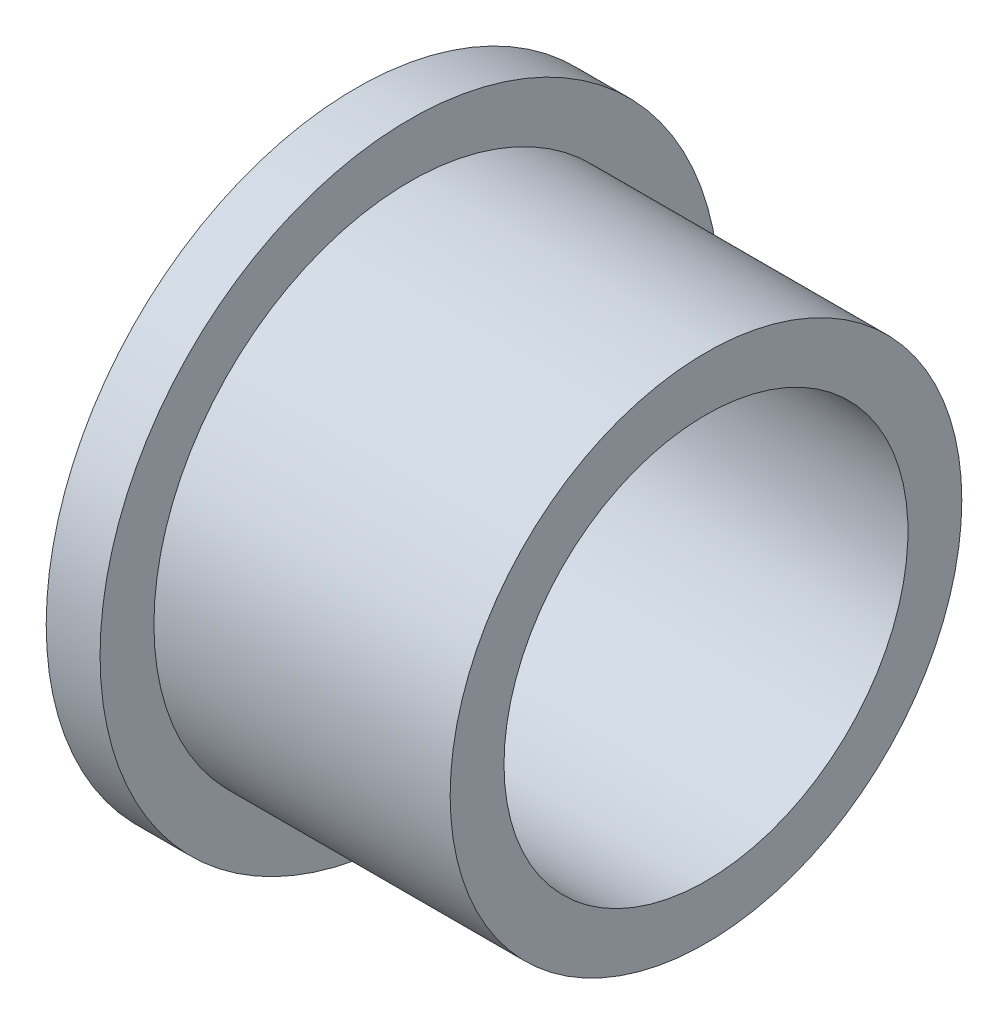
ISO-10303-21;
HEADER;
FILE_DESCRIPTION(('STEP AP214'),'2;1');
FILE_NAME('part.step','',(''),(''),'','','');
FILE_SCHEMA(('AUTOMOTIVE_DESIGN { 1 0 10303 214 1 1 1 1 }'));
ENDSEC;
DATA;
#1=APPLICATION_CONTEXT('core data for automotive mechanical design processes');
#2=APPLICATION_PROTOCOL_DEFINITION('international standard','automotive_design',2000,#1);
#3=PRODUCT_CONTEXT('',#1,'mechanical');
#4=PRODUCT('Part','Part','',(#3));
#5=PRODUCT_RELATED_PRODUCT_CATEGORY('part','',(#4));
#6=PRODUCT_DEFINITION_FORMATION('','',#4);
#7=PRODUCT_DEFINITION_CONTEXT('part definition',#1,'design');
#8=PRODUCT_DEFINITION('design','',#6,#7);
#9=PRODUCT_DEFINITION_SHAPE('','',#8);
#10=(LENGTH_UNIT() NAMED_UNIT(*) SI_UNIT(.MILLI.,.METRE.));
#11=(NAMED_UNIT(*) PLANE_ANGLE_UNIT() SI_UNIT($,.RADIAN.));
#12=(NAMED_UNIT(*) SI_UNIT($,.STERADIAN.) SOLID_ANGLE_UNIT());
#13=UNCERTAINTY_MEASURE_WITH_UNIT(LENGTH_MEASURE(1.E-05),#10,'distance_accuracy_value','');
#14=(GEOMETRIC_REPRESENTATION_CONTEXT(3) GLOBAL_UNCERTAINTY_ASSIGNED_CONTEXT((#13)) GLOBAL_UNIT_ASSIGNED_CONTEXT((#10,
#11,#12)) REPRESENTATION_CONTEXT('',''));
#15=CARTESIAN_POINT('',(0.,0.,0.));
#16=DIRECTION('',(0.,0.,1.));
#17=DIRECTION('',(1.,0.,0.));
#18=AXIS2_PLACEMENT_3D('',#15,#16,#17);
#19=CARTESIAN_POINT('',(0.,0.,0.));
#20=DIRECTION('',(-1.,0.,0.));
#21=DIRECTION('',(0.,0.,1.));
#22=AXIS2_PLACEMENT_3D('',#19,#20,#21);
#23=CYLINDRICAL_SURFACE('',#22,7.5);
#24=CARTESIAN_POINT('',(13.,0.,0.));
#25=DIRECTION('',(-1.,0.,0.));
#26=DIRECTION('',(0.,0.,1.));
#27=AXIS2_PLACEMENT_3D('',#24,#25,#26);
#28=CIRCLE('',#27,7.5);
#29=CARTESIAN_POINT('',(13.,0.,7.5));
#30=VERTEX_POINT('',#29);
#31=EDGE_CURVE('E36',#30,#30,#28,.T.);
#32=ORIENTED_EDGE('',*,*,#31,.F.);
#33=EDGE_LOOP('',(#32));
#34=FACE_BOUND('',#33,.T.);
#35=CARTESIAN_POINT('',(0.,0.,0.));
#36=DIRECTION('',(-1.,0.,0.));
#37=DIRECTION('',(0.,0.,1.));
#38=AXIS2_PLACEMENT_3D('',#35,#36,#37);
#39=CIRCLE('',#38,7.5);
#40=CARTESIAN_POINT('',(0.,0.,7.5));
#41=VERTEX_POINT('',#40);
#42=EDGE_CURVE('E10',#41,#41,#39,.T.);
#43=ORIENTED_EDGE('',*,*,#42,.T.);
#44=EDGE_LOOP('',(#43));
#45=FACE_BOUND('',#44,.T.);
#46=ADVANCED_FACE('F14',(#34,#45),#23,.F.);
#47=CARTESIAN_POINT('',(0.,7.5,0.));
#48=DIRECTION('',(1.,0.,0.));
#49=DIRECTION('',(0.,0.,-1.));
#50=AXIS2_PLACEMENT_3D('',#47,#48,#49);
#51=PLANE('',#50);
#52=ORIENTED_EDGE('',*,*,#42,.F.);
#53=EDGE_LOOP('',(#52));
#54=FACE_BOUND('',#53,.T.);
#55=CARTESIAN_POINT('',(0.,0.,0.));
#56=DIRECTION('',(-1.,0.,0.));
#57=DIRECTION('',(0.,0.,1.));
#58=AXIS2_PLACEMENT_3D('',#55,#56,#57);
#59=CIRCLE('',#58,11.5);
#60=CARTESIAN_POINT('',(0.,0.,11.5));
#61=VERTEX_POINT('',#60);
#62=EDGE_CURVE('E20',#61,#61,#59,.T.);
#63=ORIENTED_EDGE('',*,*,#62,.T.);
#64=EDGE_LOOP('',(#63));
#65=FACE_BOUND('',#64,.T.);
#66=ADVANCED_FACE('F43',(#54,#65),#51,.F.);
#67=CARTESIAN_POINT('',(0.,0.,0.));
#68=DIRECTION('',(-1.,0.,0.));
#69=DIRECTION('',(0.,0.,1.));
#70=AXIS2_PLACEMENT_3D('',#67,#68,#69);
#71=CYLINDRICAL_SURFACE('',#70,11.5);
#72=ORIENTED_EDGE('',*,*,#62,.F.);
#73=EDGE_LOOP('',(#72));
#74=FACE_BOUND('',#73,.T.);
#75=CARTESIAN_POINT('',(2.,0.,0.));
#76=DIRECTION('',(-1.,0.,0.));
#77=DIRECTION('',(0.,0.,1.));
#78=AXIS2_PLACEMENT_3D('',#75,#76,#77);
#79=CIRCLE('',#78,11.5);
#80=CARTESIAN_POINT('',(2.,0.,11.5));
#81=VERTEX_POINT('',#80);
#82=EDGE_CURVE('E24',#81,#81,#79,.T.);
#83=ORIENTED_EDGE('',*,*,#82,.T.);
#84=EDGE_LOOP('',(#83));
#85=FACE_BOUND('',#84,.T.);
#86=ADVANCED_FACE('F49',(#74,#85),#71,.T.);
#87=CARTESIAN_POINT('',(2.,11.5,0.));
#88=DIRECTION('',(-1.,0.,0.));
#89=DIRECTION('',(0.,0.,1.));
#90=AXIS2_PLACEMENT_3D('',#87,#88,#89);
#91=PLANE('',#90);
#92=ORIENTED_EDGE('',*,*,#82,.F.);
#93=EDGE_LOOP('',(#92));
#94=FACE_BOUND('',#93,.T.);
#95=CARTESIAN_POINT('',(2.,0.,0.));
#96=DIRECTION('',(-1.,0.,0.));
#97=DIRECTION('',(0.,0.,1.));
#98=AXIS2_PLACEMENT_3D('',#95,#96,#97);
#99=CIRCLE('',#98,9.5);
#100=CARTESIAN_POINT('',(2.,0.,9.5));
#101=VERTEX_POINT('',#100);
#102=EDGE_CURVE('E28',#101,#101,#99,.T.);
#103=ORIENTED_EDGE('',*,*,#102,.T.);
#104=EDGE_LOOP('',(#103));
#105=FACE_BOUND('',#104,.T.);
#106=ADVANCED_FACE('F55',(#94,#105),#91,.F.);
#107=CARTESIAN_POINT('',(0.,0.,0.));
#108=DIRECTION('',(-1.,0.,0.));
#109=DIRECTION('',(0.,0.,1.));
#110=AXIS2_PLACEMENT_3D('',#107,#108,#109);
#111=CYLINDRICAL_SURFACE('',#110,9.5);
#112=ORIENTED_EDGE('',*,*,#102,.F.);
#113=EDGE_LOOP('',(#112));
#114=FACE_BOUND('',#113,.T.);
#115=CARTESIAN_POINT('',(13.,0.,0.));
#116=DIRECTION('',(-1.,0.,0.));
#117=DIRECTION('',(0.,0.,1.));
#118=AXIS2_PLACEMENT_3D('',#115,#116,#117);
#119=CIRCLE('',#118,9.5);
#120=CARTESIAN_POINT('',(13.,0.,9.5));
#121=VERTEX_POINT('',#120);
#122=EDGE_CURVE('E33',#121,#121,#119,.T.);
#123=ORIENTED_EDGE('',*,*,#122,.T.);
#124=EDGE_LOOP('',(#123));
#125=FACE_BOUND('',#124,.T.);
#126=ADVANCED_FACE('F61',(#114,#125),#111,.T.);
#127=CARTESIAN_POINT('',(13.,9.5,0.));
#128=DIRECTION('',(-1.,0.,0.));
#129=DIRECTION('',(0.,0.,1.));
#130=AXIS2_PLACEMENT_3D('',#127,#128,#129);
#131=PLANE('',#130);
#132=ORIENTED_EDGE('',*,*,#122,.F.);
#133=EDGE_LOOP('',(#132));
#134=FACE_BOUND('',#133,.T.);
#135=ORIENTED_EDGE('',*,*,#31,.T.);
#136=EDGE_LOOP('',(#135));
#137=FACE_BOUND('',#136,.T.);
#138=ADVANCED_FACE('F40',(#134,#137),#131,.F.);
#139=CLOSED_SHELL('',(#46,#66,#86,#106,#126,#138));
#140=MANIFOLD_SOLID_BREP('B1',#139);
#141=ADVANCED_BREP_SHAPE_REPRESENTATION('',(#18,#140),#14);
#142=SHAPE_DEFINITION_REPRESENTATION(#9,#141);
ENDSEC;
END-ISO-10303-21;
